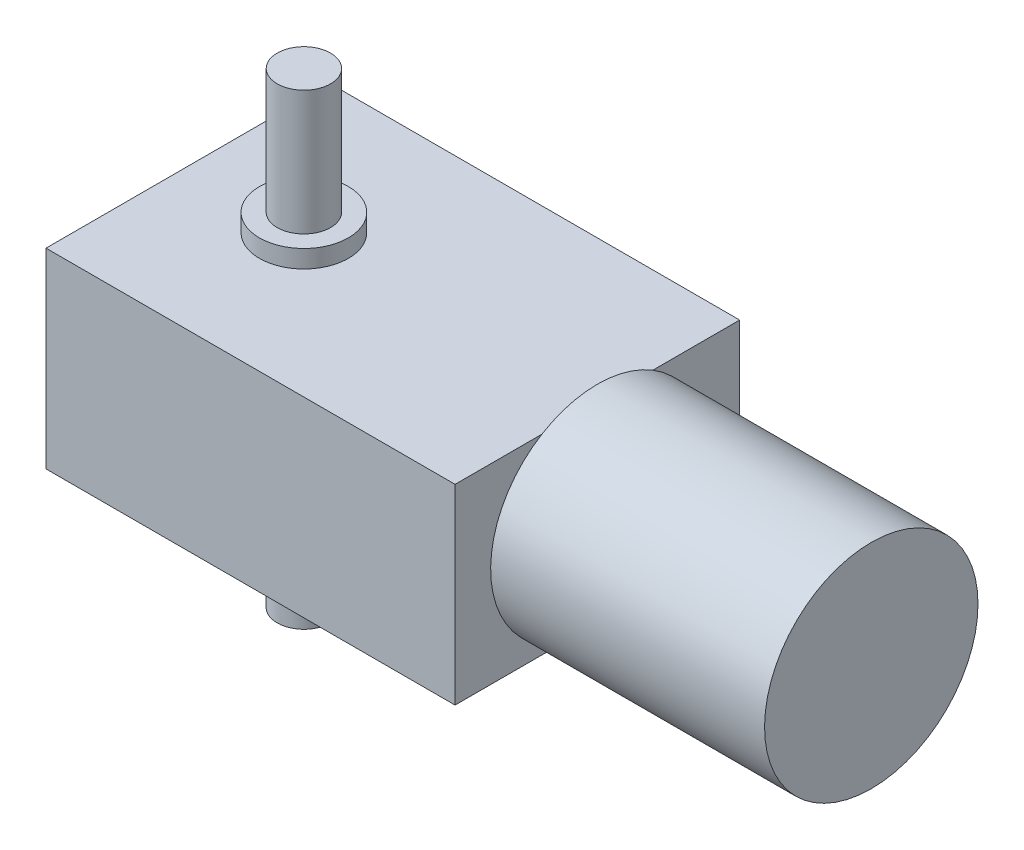
ISO-10303-21;
HEADER;
FILE_DESCRIPTION(('STEP AP214'),'2;1');
FILE_NAME('part.step','',(''),(''),'','','');
FILE_SCHEMA(('AUTOMOTIVE_DESIGN { 1 0 10303 214 1 1 1 1 }'));
ENDSEC;
DATA;
#1=APPLICATION_CONTEXT('core data for automotive mechanical design processes');
#2=APPLICATION_PROTOCOL_DEFINITION('international standard','automotive_design',2000,#1);
#3=PRODUCT_CONTEXT('',#1,'mechanical');
#4=PRODUCT('Part','Part','',(#3));
#5=PRODUCT_RELATED_PRODUCT_CATEGORY('part','',(#4));
#6=PRODUCT_DEFINITION_FORMATION('','',#4);
#7=PRODUCT_DEFINITION_CONTEXT('part definition',#1,'design');
#8=PRODUCT_DEFINITION('design','',#6,#7);
#9=PRODUCT_DEFINITION_SHAPE('','',#8);
#10=(LENGTH_UNIT() NAMED_UNIT(*) SI_UNIT(.MILLI.,.METRE.));
#11=(NAMED_UNIT(*) PLANE_ANGLE_UNIT() SI_UNIT($,.RADIAN.));
#12=(NAMED_UNIT(*) SI_UNIT($,.STERADIAN.) SOLID_ANGLE_UNIT());
#13=UNCERTAINTY_MEASURE_WITH_UNIT(LENGTH_MEASURE(1.E-05),#10,'distance_accuracy_value','');
#14=(GEOMETRIC_REPRESENTATION_CONTEXT(3) GLOBAL_UNCERTAINTY_ASSIGNED_CONTEXT((#13)) GLOBAL_UNIT_ASSIGNED_CONTEXT((#10,
#11,#12)) REPRESENTATION_CONTEXT('',''));
#15=CARTESIAN_POINT('',(0.,0.,0.));
#16=DIRECTION('',(0.,0.,1.));
#17=DIRECTION('',(1.,0.,0.));
#18=AXIS2_PLACEMENT_3D('',#15,#16,#17);
#19=CARTESIAN_POINT('',(25.6471171709923,6.25603715663995,32.));
#20=DIRECTION('',(-1.,0.,0.));
#21=DIRECTION('',(0.,0.,1.));
#22=AXIS2_PLACEMENT_3D('',#19,#20,#21);
#23=PLANE('',#22);
#24=CARTESIAN_POINT('',(25.6471171709923,17.5060371566399,16.));
#25=DIRECTION('',(1.,0.,0.));
#26=DIRECTION('',(0.,0.,-1.));
#27=AXIS2_PLACEMENT_3D('',#24,#25,#26);
#28=CIRCLE('',#27,12.);
#29=CARTESIAN_POINT('',(25.6471171709923,27.7560371566399,22.2399919871743));
#30=VERTEX_POINT('',#29);
#31=CARTESIAN_POINT('',(25.6471171709923,6.25603715663995,20.1758232721225));
#32=VERTEX_POINT('',#31);
#33=EDGE_CURVE('E11',#30,#32,#28,.T.);
#34=ORIENTED_EDGE('',*,*,#33,.F.);
#35=DIRECTION('',(0.,0.,-1.));
#36=VECTOR('',#35,1.);
#37=CARTESIAN_POINT('',(25.6471171709923,27.7560371566399,32.));
#38=LINE('',#37,#36);
#39=CARTESIAN_POINT('',(25.6471171709923,27.7560371566399,32.));
#40=VERTEX_POINT('',#39);
#41=EDGE_CURVE('E98',#40,#30,#38,.T.);
#42=ORIENTED_EDGE('',*,*,#41,.F.);
#43=DIRECTION('',(0.,1.,0.));
#44=VECTOR('',#43,1.);
#45=CARTESIAN_POINT('',(25.6471171709923,6.25603715663995,32.));
#46=LINE('',#45,#44);
#47=CARTESIAN_POINT('',(25.6471171709923,6.25603715663995,32.));
#48=VERTEX_POINT('',#47);
#49=EDGE_CURVE('E107',#48,#40,#46,.T.);
#50=ORIENTED_EDGE('',*,*,#49,.F.);
#51=DIRECTION('',(0.,0.,-1.));
#52=VECTOR('',#51,1.);
#53=CARTESIAN_POINT('',(25.6471171709923,6.25603715663995,32.));
#54=LINE('',#53,#52);
#55=EDGE_CURVE('E154',#48,#32,#54,.T.);
#56=ORIENTED_EDGE('',*,*,#55,.T.);
#57=EDGE_LOOP('',(#34,#42,#50,#56));
#58=FACE_BOUND('',#57,.T.);
#59=ADVANCED_FACE('F35',(#58),#23,.F.);
#60=CARTESIAN_POINT('',(25.6471171709923,27.7560371566399,32.));
#61=DIRECTION('',(0.,-1.,0.));
#62=DIRECTION('',(0.,0.,-1.));
#63=AXIS2_PLACEMENT_3D('',#60,#61,#62);
#64=PLANE('',#63);
#65=CARTESIAN_POINT('',(-7.35288282900768,27.7560371566399,16.));
#66=DIRECTION('',(0.,-1.,0.));
#67=DIRECTION('',(0.,0.,-1.));
#68=AXIS2_PLACEMENT_3D('',#65,#66,#67);
#69=CIRCLE('',#68,5.);
#70=CARTESIAN_POINT('',(-7.35288282900768,27.7560371566399,11.));
#71=VERTEX_POINT('',#70);
#72=EDGE_CURVE('E134',#71,#71,#69,.F.);
#73=ORIENTED_EDGE('',*,*,#72,.F.);
#74=EDGE_LOOP('',(#73));
#75=FACE_BOUND('',#74,.T.);
#76=DIRECTION('',(-1.,0.,0.));
#77=VECTOR('',#76,1.);
#78=CARTESIAN_POINT('',(25.6471171709923,27.7560371566399,0.));
#79=LINE('',#78,#77);
#80=CARTESIAN_POINT('',(25.6471171709923,27.7560371566399,0.));
#81=VERTEX_POINT('',#80);
#82=CARTESIAN_POINT('',(-20.3528828290077,27.7560371566399,0.));
#83=VERTEX_POINT('',#82);
#84=EDGE_CURVE('E137',#81,#83,#79,.T.);
#85=ORIENTED_EDGE('',*,*,#84,.T.);
#86=DIRECTION('',(0.,0.,-1.));
#87=VECTOR('',#86,1.);
#88=CARTESIAN_POINT('',(-20.3528828290077,27.7560371566399,32.));
#89=LINE('',#88,#87);
#90=CARTESIAN_POINT('',(-20.3528828290077,27.7560371566399,32.));
#91=VERTEX_POINT('',#90);
#92=EDGE_CURVE('E159',#91,#83,#89,.T.);
#93=ORIENTED_EDGE('',*,*,#92,.F.);
#94=DIRECTION('',(-1.,0.,0.));
#95=VECTOR('',#94,1.);
#96=CARTESIAN_POINT('',(25.6471171709923,27.7560371566399,32.));
#97=LINE('',#96,#95);
#98=EDGE_CURVE('E138',#40,#91,#97,.T.);
#99=ORIENTED_EDGE('',*,*,#98,.F.);
#100=ORIENTED_EDGE('',*,*,#41,.T.);
#101=CARTESIAN_POINT('',(25.6471171709923,27.7560371566399,9.76000801282566));
#102=VERTEX_POINT('',#101);
#103=EDGE_CURVE('E92',#30,#102,#38,.T.);
#104=ORIENTED_EDGE('',*,*,#103,.T.);
#105=EDGE_CURVE('E94',#102,#81,#38,.T.);
#106=ORIENTED_EDGE('',*,*,#105,.T.);
#107=EDGE_LOOP('',(#85,#93,#99,#100,#104,#106));
#108=FACE_BOUND('',#107,.T.);
#109=ADVANCED_FACE('F37',(#75,#108),#64,.F.);
#110=CARTESIAN_POINT('',(-20.3528828290077,27.7560371566399,32.));
#111=DIRECTION('',(1.,0.,0.));
#112=DIRECTION('',(0.,0.,-1.));
#113=AXIS2_PLACEMENT_3D('',#110,#111,#112);
#114=PLANE('',#113);
#115=DIRECTION('',(0.,-1.,0.));
#116=VECTOR('',#115,1.);
#117=CARTESIAN_POINT('',(-20.3528828290077,27.7560371566399,0.));
#118=LINE('',#117,#116);
#119=CARTESIAN_POINT('',(-20.3528828290077,6.25603715663995,0.));
#120=VERTEX_POINT('',#119);
#121=EDGE_CURVE('E147',#83,#120,#118,.T.);
#122=ORIENTED_EDGE('',*,*,#121,.T.);
#123=DIRECTION('',(0.,0.,-1.));
#124=VECTOR('',#123,1.);
#125=CARTESIAN_POINT('',(-20.3528828290077,6.25603715663995,32.));
#126=LINE('',#125,#124);
#127=CARTESIAN_POINT('',(-20.3528828290077,6.25603715663995,32.));
#128=VERTEX_POINT('',#127);
#129=EDGE_CURVE('E156',#128,#120,#126,.T.);
#130=ORIENTED_EDGE('',*,*,#129,.F.);
#131=DIRECTION('',(0.,-1.,0.));
#132=VECTOR('',#131,1.);
#133=CARTESIAN_POINT('',(-20.3528828290077,27.7560371566399,32.));
#134=LINE('',#133,#132);
#135=EDGE_CURVE('E141',#91,#128,#134,.T.);
#136=ORIENTED_EDGE('',*,*,#135,.F.);
#137=ORIENTED_EDGE('',*,*,#92,.T.);
#138=EDGE_LOOP('',(#122,#130,#136,#137));
#139=FACE_BOUND('',#138,.T.);
#140=ADVANCED_FACE('F167',(#139),#114,.F.);
#141=CARTESIAN_POINT('',(-20.3528828290077,6.25603715663995,32.));
#142=DIRECTION('',(0.,1.,0.));
#143=DIRECTION('',(0.,0.,1.));
#144=AXIS2_PLACEMENT_3D('',#141,#142,#143);
#145=PLANE('',#144);
#146=CARTESIAN_POINT('',(-7.35288282900768,6.25603715663995,16.));
#147=DIRECTION('',(0.,1.,0.));
#148=DIRECTION('',(0.,0.,1.));
#149=AXIS2_PLACEMENT_3D('',#146,#147,#148);
#150=CIRCLE('',#149,5.);
#151=CARTESIAN_POINT('',(-7.35288282900768,6.25603715663995,21.));
#152=VERTEX_POINT('',#151);
#153=EDGE_CURVE('E39',#152,#152,#150,.T.);
#154=ORIENTED_EDGE('',*,*,#153,.T.);
#155=EDGE_LOOP('',(#154));
#156=FACE_BOUND('',#155,.T.);
#157=DIRECTION('',(1.,0.,0.));
#158=VECTOR('',#157,1.);
#159=CARTESIAN_POINT('',(-20.3528828290077,6.25603715663995,0.));
#160=LINE('',#159,#158);
#161=CARTESIAN_POINT('',(25.6471171709923,6.25603715663995,0.));
#162=VERTEX_POINT('',#161);
#163=EDGE_CURVE('E149',#120,#162,#160,.T.);
#164=ORIENTED_EDGE('',*,*,#163,.T.);
#165=CARTESIAN_POINT('',(25.6471171709923,6.25603715663995,11.8241767278775));
#166=VERTEX_POINT('',#165);
#167=EDGE_CURVE('E153',#166,#162,#54,.T.);
#168=ORIENTED_EDGE('',*,*,#167,.F.);
#169=EDGE_CURVE('E59',#32,#166,#54,.T.);
#170=ORIENTED_EDGE('',*,*,#169,.F.);
#171=ORIENTED_EDGE('',*,*,#55,.F.);
#172=DIRECTION('',(1.,0.,0.));
#173=VECTOR('',#172,1.);
#174=CARTESIAN_POINT('',(-20.3528828290077,6.25603715663995,32.));
#175=LINE('',#174,#173);
#176=EDGE_CURVE('E143',#128,#48,#175,.T.);
#177=ORIENTED_EDGE('',*,*,#176,.F.);
#178=ORIENTED_EDGE('',*,*,#129,.T.);
#179=EDGE_LOOP('',(#164,#168,#170,#171,#177,#178));
#180=FACE_BOUND('',#179,.T.);
#181=ADVANCED_FACE('F172',(#156,#180),#145,.F.);
#182=EDGE_CURVE('E44',#166,#102,#28,.T.);
#183=ORIENTED_EDGE('',*,*,#182,.F.);
#184=ORIENTED_EDGE('',*,*,#167,.T.);
#185=DIRECTION('',(0.,1.,0.));
#186=VECTOR('',#185,1.);
#187=CARTESIAN_POINT('',(25.6471171709923,6.25603715663995,0.));
#188=LINE('',#187,#186);
#189=EDGE_CURVE('E105',#162,#81,#188,.T.);
#190=ORIENTED_EDGE('',*,*,#189,.T.);
#191=ORIENTED_EDGE('',*,*,#105,.F.);
#192=EDGE_LOOP('',(#183,#184,#190,#191));
#193=FACE_BOUND('',#192,.T.);
#194=ADVANCED_FACE('F103',(#193),#23,.F.);
#195=CARTESIAN_POINT('',(0.,0.,32.));
#196=DIRECTION('',(0.,0.,1.));
#197=DIRECTION('',(1.,0.,0.));
#198=AXIS2_PLACEMENT_3D('',#195,#196,#197);
#199=PLANE('',#198);
#200=ORIENTED_EDGE('',*,*,#98,.T.);
#201=ORIENTED_EDGE('',*,*,#135,.T.);
#202=ORIENTED_EDGE('',*,*,#176,.T.);
#203=ORIENTED_EDGE('',*,*,#49,.T.);
#204=EDGE_LOOP('',(#200,#201,#202,#203));
#205=FACE_BOUND('',#204,.T.);
#206=ADVANCED_FACE('F181',(#205),#199,.T.);
#207=CARTESIAN_POINT('',(0.,0.,0.));
#208=DIRECTION('',(0.,0.,1.));
#209=DIRECTION('',(1.,0.,0.));
#210=AXIS2_PLACEMENT_3D('',#207,#208,#209);
#211=PLANE('',#210);
#212=ORIENTED_EDGE('',*,*,#84,.F.);
#213=ORIENTED_EDGE('',*,*,#189,.F.);
#214=ORIENTED_EDGE('',*,*,#163,.F.);
#215=ORIENTED_EDGE('',*,*,#121,.F.);
#216=EDGE_LOOP('',(#212,#213,#214,#215));
#217=FACE_BOUND('',#216,.T.);
#218=ADVANCED_FACE('F186',(#217),#211,.F.);
#219=CARTESIAN_POINT('',(-7.35288282900768,29.75603715664,16.));
#220=DIRECTION('',(0.,-1.,0.));
#221=DIRECTION('',(0.,0.,-1.));
#222=AXIS2_PLACEMENT_3D('',#219,#220,#221);
#223=CYLINDRICAL_SURFACE('',#222,5.);
#224=CARTESIAN_POINT('',(-7.35288282900768,29.75603715664,16.));
#225=DIRECTION('',(0.,1.,0.));
#226=DIRECTION('',(0.,0.,1.));
#227=AXIS2_PLACEMENT_3D('',#224,#225,#226);
#228=CIRCLE('',#227,5.);
#229=CARTESIAN_POINT('',(-7.35288282900768,29.75603715664,21.));
#230=VERTEX_POINT('',#229);
#231=EDGE_CURVE('E131',#230,#230,#228,.T.);
#232=ORIENTED_EDGE('',*,*,#231,.F.);
#233=EDGE_LOOP('',(#232));
#234=FACE_BOUND('',#233,.T.);
#235=ORIENTED_EDGE('',*,*,#72,.T.);
#236=EDGE_LOOP('',(#235));
#237=FACE_BOUND('',#236,.T.);
#238=ADVANCED_FACE('F164',(#234,#237),#223,.T.);
#239=CARTESIAN_POINT('',(-7.35288282900768,29.75603715664,16.));
#240=DIRECTION('',(0.,1.,0.));
#241=DIRECTION('',(0.,0.,1.));
#242=AXIS2_PLACEMENT_3D('',#239,#240,#241);
#243=PLANE('',#242);
#244=CARTESIAN_POINT('',(-7.35288282900768,29.75603715664,16.));
#245=DIRECTION('',(0.,1.,0.));
#246=DIRECTION('',(0.,0.,1.));
#247=AXIS2_PLACEMENT_3D('',#244,#245,#246);
#248=CIRCLE('',#247,3.);
#249=CARTESIAN_POINT('',(-7.35288282900768,29.75603715664,19.));
#250=VERTEX_POINT('',#249);
#251=EDGE_CURVE('E113',#250,#250,#248,.T.);
#252=ORIENTED_EDGE('',*,*,#251,.F.);
#253=EDGE_LOOP('',(#252));
#254=FACE_BOUND('',#253,.T.);
#255=ORIENTED_EDGE('',*,*,#231,.T.);
#256=EDGE_LOOP('',(#255));
#257=FACE_BOUND('',#256,.T.);
#258=ADVANCED_FACE('F305',(#254,#257),#243,.T.);
#259=CARTESIAN_POINT('',(-7.35288282900768,43.7560371566399,16.));
#260=DIRECTION('',(0.,-1.,0.));
#261=DIRECTION('',(0.,0.,-1.));
#262=AXIS2_PLACEMENT_3D('',#259,#260,#261);
#263=CYLINDRICAL_SURFACE('',#262,3.);
#264=CARTESIAN_POINT('',(-7.35288282900768,43.7560371566399,16.));
#265=DIRECTION('',(0.,1.,0.));
#266=DIRECTION('',(0.,0.,1.));
#267=AXIS2_PLACEMENT_3D('',#264,#265,#266);
#268=CIRCLE('',#267,3.);
#269=CARTESIAN_POINT('',(-7.35288282900768,43.7560371566399,19.));
#270=VERTEX_POINT('',#269);
#271=EDGE_CURVE('E128',#270,#270,#268,.T.);
#272=ORIENTED_EDGE('',*,*,#271,.F.);
#273=EDGE_LOOP('',(#272));
#274=FACE_BOUND('',#273,.T.);
#275=ORIENTED_EDGE('',*,*,#251,.T.);
#276=EDGE_LOOP('',(#275));
#277=FACE_BOUND('',#276,.T.);
#278=ADVANCED_FACE('F295',(#274,#277),#263,.T.);
#279=CARTESIAN_POINT('',(-7.35288282900768,43.7560371566399,16.));
#280=DIRECTION('',(0.,1.,0.));
#281=DIRECTION('',(0.,0.,1.));
#282=AXIS2_PLACEMENT_3D('',#279,#280,#281);
#283=PLANE('',#282);
#284=ORIENTED_EDGE('',*,*,#271,.T.);
#285=EDGE_LOOP('',(#284));
#286=FACE_BOUND('',#285,.T.);
#287=ADVANCED_FACE('F285',(#286),#283,.T.);
#288=CARTESIAN_POINT('',(-7.35288282900768,5.25603715663994,16.));
#289=DIRECTION('',(0.,1.,0.));
#290=DIRECTION('',(0.,0.,1.));
#291=AXIS2_PLACEMENT_3D('',#288,#289,#290);
#292=CYLINDRICAL_SURFACE('',#291,5.);
#293=CARTESIAN_POINT('',(-7.35288282900768,5.25603715663994,16.));
#294=DIRECTION('',(0.,1.,0.));
#295=DIRECTION('',(0.,0.,1.));
#296=AXIS2_PLACEMENT_3D('',#293,#294,#295);
#297=CIRCLE('',#296,5.);
#298=CARTESIAN_POINT('',(-7.35288282900768,5.25603715663994,21.));
#299=VERTEX_POINT('',#298);
#300=EDGE_CURVE('E123',#299,#299,#297,.T.);
#301=ORIENTED_EDGE('',*,*,#300,.T.);
#302=EDGE_LOOP('',(#301));
#303=FACE_BOUND('',#302,.T.);
#304=ORIENTED_EDGE('',*,*,#153,.F.);
#305=EDGE_LOOP('',(#304));
#306=FACE_BOUND('',#305,.T.);
#307=ADVANCED_FACE('F275',(#303,#306),#292,.T.);
#308=CARTESIAN_POINT('',(-7.35288282900768,5.25603715663994,16.));
#309=DIRECTION('',(0.,-1.,0.));
#310=DIRECTION('',(0.,0.,1.));
#311=AXIS2_PLACEMENT_3D('',#308,#309,#310);
#312=PLANE('',#311);
#313=CARTESIAN_POINT('',(-7.35288282900768,5.25603715663994,16.));
#314=DIRECTION('',(0.,1.,0.));
#315=DIRECTION('',(0.,0.,1.));
#316=AXIS2_PLACEMENT_3D('',#313,#314,#315);
#317=CIRCLE('',#316,3.);
#318=CARTESIAN_POINT('',(-7.35288282900768,5.25603715663994,19.));
#319=VERTEX_POINT('',#318);
#320=EDGE_CURVE('E117',#319,#319,#317,.T.);
#321=ORIENTED_EDGE('',*,*,#320,.T.);
#322=EDGE_LOOP('',(#321));
#323=FACE_BOUND('',#322,.T.);
#324=ORIENTED_EDGE('',*,*,#300,.F.);
#325=EDGE_LOOP('',(#324));
#326=FACE_BOUND('',#325,.T.);
#327=ADVANCED_FACE('F265',(#323,#326),#312,.T.);
#328=CARTESIAN_POINT('',(-7.35288282900768,-8.74396284336006,16.));
#329=DIRECTION('',(0.,1.,0.));
#330=DIRECTION('',(0.,0.,1.));
#331=AXIS2_PLACEMENT_3D('',#328,#329,#330);
#332=CYLINDRICAL_SURFACE('',#331,3.);
#333=CARTESIAN_POINT('',(-7.35288282900768,-8.74396284336006,16.));
#334=DIRECTION('',(0.,1.,0.));
#335=DIRECTION('',(0.,0.,1.));
#336=AXIS2_PLACEMENT_3D('',#333,#334,#335);
#337=CIRCLE('',#336,3.);
#338=CARTESIAN_POINT('',(-7.35288282900768,-8.74396284336006,19.));
#339=VERTEX_POINT('',#338);
#340=EDGE_CURVE('E120',#339,#339,#337,.T.);
#341=ORIENTED_EDGE('',*,*,#340,.T.);
#342=EDGE_LOOP('',(#341));
#343=FACE_BOUND('',#342,.T.);
#344=ORIENTED_EDGE('',*,*,#320,.F.);
#345=EDGE_LOOP('',(#344));
#346=FACE_BOUND('',#345,.T.);
#347=ADVANCED_FACE('F212',(#343,#346),#332,.T.);
#348=CARTESIAN_POINT('',(-7.35288282900768,-8.74396284336006,16.));
#349=DIRECTION('',(0.,-1.,0.));
#350=DIRECTION('',(0.,0.,1.));
#351=AXIS2_PLACEMENT_3D('',#348,#349,#350);
#352=PLANE('',#351);
#353=ORIENTED_EDGE('',*,*,#340,.F.);
#354=EDGE_LOOP('',(#353));
#355=FACE_BOUND('',#354,.T.);
#356=ADVANCED_FACE('F203',(#355),#352,.T.);
#357=CARTESIAN_POINT('',(25.6471171709923,17.5060371566399,16.));
#358=DIRECTION('',(1.,0.,0.));
#359=DIRECTION('',(0.,0.,-1.));
#360=AXIS2_PLACEMENT_3D('',#357,#358,#359);
#361=PLANE('',#360);
#362=EDGE_CURVE('E46',#32,#166,#28,.T.);
#363=ORIENTED_EDGE('',*,*,#362,.F.);
#364=ORIENTED_EDGE('',*,*,#169,.T.);
#365=EDGE_LOOP('',(#363,#364));
#366=FACE_BOUND('',#365,.T.);
#367=ADVANCED_FACE('F201',(#366),#361,.F.);
#368=CARTESIAN_POINT('',(56.4471171709923,17.5060371566399,16.));
#369=DIRECTION('',(-1.,0.,0.));
#370=DIRECTION('',(0.,0.,1.));
#371=AXIS2_PLACEMENT_3D('',#368,#369,#370);
#372=CYLINDRICAL_SURFACE('',#371,12.);
#373=CARTESIAN_POINT('',(56.4471171709923,17.5060371566399,16.));
#374=DIRECTION('',(1.,0.,0.));
#375=DIRECTION('',(0.,0.,-1.));
#376=AXIS2_PLACEMENT_3D('',#373,#374,#375);
#377=CIRCLE('',#376,12.);
#378=CARTESIAN_POINT('',(56.4471171709923,17.5060371566399,4.));
#379=VERTEX_POINT('',#378);
#380=EDGE_CURVE('E115',#379,#379,#377,.T.);
#381=ORIENTED_EDGE('',*,*,#380,.F.);
#382=EDGE_LOOP('',(#381));
#383=FACE_BOUND('',#382,.T.);
#384=EDGE_CURVE('E111',#102,#30,#28,.T.);
#385=ORIENTED_EDGE('',*,*,#384,.T.);
#386=ORIENTED_EDGE('',*,*,#33,.T.);
#387=ORIENTED_EDGE('',*,*,#362,.T.);
#388=ORIENTED_EDGE('',*,*,#182,.T.);
#389=EDGE_LOOP('',(#385,#386,#387,#388));
#390=FACE_BOUND('',#389,.T.);
#391=ADVANCED_FACE('F110',(#383,#390),#372,.T.);
#392=CARTESIAN_POINT('',(56.4471171709923,17.5060371566399,16.));
#393=DIRECTION('',(1.,0.,0.));
#394=DIRECTION('',(0.,0.,-1.));
#395=AXIS2_PLACEMENT_3D('',#392,#393,#394);
#396=PLANE('',#395);
#397=ORIENTED_EDGE('',*,*,#380,.T.);
#398=EDGE_LOOP('',(#397));
#399=FACE_BOUND('',#398,.T.);
#400=ADVANCED_FACE('F209',(#399),#396,.T.);
#401=ORIENTED_EDGE('',*,*,#103,.F.);
#402=ORIENTED_EDGE('',*,*,#384,.F.);
#403=EDGE_LOOP('',(#401,#402));
#404=FACE_BOUND('',#403,.T.);
#405=ADVANCED_FACE('F114',(#404),#361,.F.);
#406=CLOSED_SHELL('',(#59,#109,#140,#181,#194,#206,#218,#238,#258,#278,#287,#307,#327,#347,#356,
#367,#391,#400,#405));
#407=MANIFOLD_SOLID_BREP('B2',#406);
#408=ADVANCED_BREP_SHAPE_REPRESENTATION('',(#18,#407),#14);
#409=SHAPE_DEFINITION_REPRESENTATION(#9,#408);
ENDSEC;
END-ISO-10303-21;
